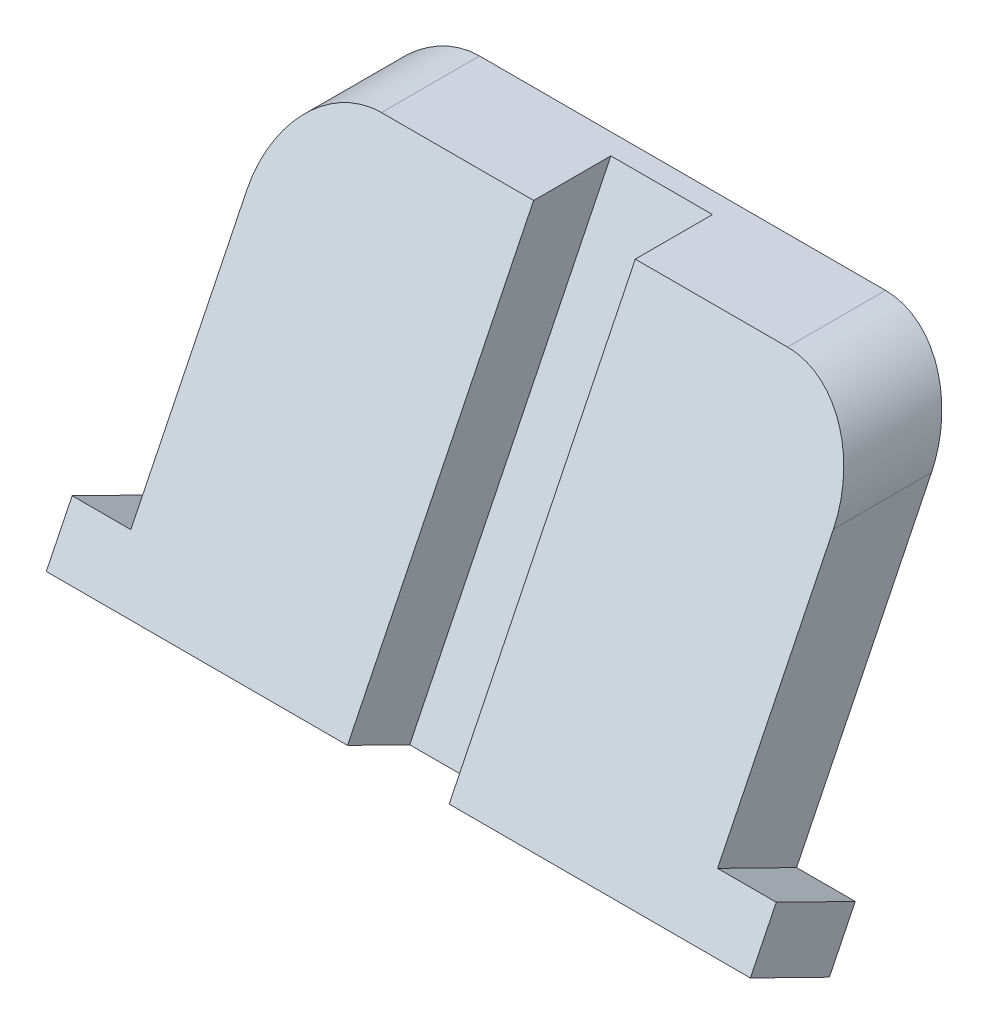
ISO-10303-21;
HEADER;
FILE_DESCRIPTION(('STEP AP214'),'2;1');
FILE_NAME('part.step','',(''),(''),'','','');
FILE_SCHEMA(('AUTOMOTIVE_DESIGN { 1 0 10303 214 1 1 1 1 }'));
ENDSEC;
DATA;
#1=APPLICATION_CONTEXT('core data for automotive mechanical design processes');
#2=APPLICATION_PROTOCOL_DEFINITION('international standard','automotive_design',2000,#1);
#3=PRODUCT_CONTEXT('',#1,'mechanical');
#4=PRODUCT('Part','Part','',(#3));
#5=PRODUCT_RELATED_PRODUCT_CATEGORY('part','',(#4));
#6=PRODUCT_DEFINITION_FORMATION('','',#4);
#7=PRODUCT_DEFINITION_CONTEXT('part definition',#1,'design');
#8=PRODUCT_DEFINITION('design','',#6,#7);
#9=PRODUCT_DEFINITION_SHAPE('','',#8);
#10=(LENGTH_UNIT() NAMED_UNIT(*) SI_UNIT(.MILLI.,.METRE.));
#11=(NAMED_UNIT(*) PLANE_ANGLE_UNIT() SI_UNIT($,.RADIAN.));
#12=(NAMED_UNIT(*) SI_UNIT($,.STERADIAN.) SOLID_ANGLE_UNIT());
#13=UNCERTAINTY_MEASURE_WITH_UNIT(LENGTH_MEASURE(1.E-05),#10,'distance_accuracy_value','');
#14=(GEOMETRIC_REPRESENTATION_CONTEXT(3) GLOBAL_UNCERTAINTY_ASSIGNED_CONTEXT((#13)) GLOBAL_UNIT_ASSIGNED_CONTEXT((#10,
#11,#12)) REPRESENTATION_CONTEXT('',''));
#15=CARTESIAN_POINT('',(0.,0.,0.));
#16=DIRECTION('',(0.,0.,1.));
#17=DIRECTION('',(1.,0.,0.));
#18=AXIS2_PLACEMENT_3D('',#15,#16,#17);
#19=CARTESIAN_POINT('',(-127.,0.,0.));
#20=DIRECTION('',(1.,0.,0.));
#21=DIRECTION('',(0.,0.,-1.));
#22=AXIS2_PLACEMENT_3D('',#19,#20,#21);
#23=PLANE('',#22);
#24=DIRECTION('',(0.,-0.440928700990651,-0.897542133073817));
#25=VECTOR('',#24,1.);
#26=CARTESIAN_POINT('',(-127.,311.889909229583,66.9616760532339));
#27=LINE('',#26,#25);
#28=CARTESIAN_POINT('',(-127.,328.689292737327,101.158031323346));
#29=VERTEX_POINT('',#28);
#30=CARTESIAN_POINT('',(-127.,311.889909229583,66.9616760532339));
#31=VERTEX_POINT('',#30);
#32=EDGE_CURVE('E56',#29,#31,#27,.T.);
#33=ORIENTED_EDGE('',*,*,#32,.F.);
#34=DIRECTION('',(0.,-0.897542133073816,0.440928700990653));
#35=VECTOR('',#34,1.);
#36=CARTESIAN_POINT('',(-127.,342.9,94.1768451900222));
#37=LINE('',#36,#35);
#38=CARTESIAN_POINT('',(-127.,430.784,51.0027405659269));
#39=VERTEX_POINT('',#38);
#40=EDGE_CURVE('E237',#39,#29,#37,.T.);
#41=ORIENTED_EDGE('',*,*,#40,.F.);
#42=DIRECTION('',(0.,0.,1.));
#43=VECTOR('',#42,1.);
#44=CARTESIAN_POINT('',(-127.,430.784,0.));
#45=LINE('',#44,#43);
#46=CARTESIAN_POINT('',(-127.,430.784,8.55347986156453));
#47=VERTEX_POINT('',#46);
#48=EDGE_CURVE('E248',#39,#47,#45,.F.);
#49=ORIENTED_EDGE('',*,*,#48,.T.);
#50=DIRECTION('',(0.,0.897542133073816,-0.440928700990653));
#51=VECTOR('',#50,1.);
#52=CARTESIAN_POINT('',(-127.,342.9,51.7275844856598));
#53=LINE('',#52,#51);
#54=EDGE_CURVE('E235',#31,#47,#53,.T.);
#55=ORIENTED_EDGE('',*,*,#54,.F.);
#56=EDGE_LOOP('',(#33,#41,#49,#55));
#57=FACE_BOUND('',#56,.T.);
#58=ADVANCED_FACE('F41',(#57),#23,.F.);
#59=CARTESIAN_POINT('',(127.,342.9,94.1768451900222));
#60=DIRECTION('',(0.,-0.440928700990653,-0.897542133073816));
#61=DIRECTION('',(0.,0.897542133073816,-0.440928700990653));
#62=AXIS2_PLACEMENT_3D('',#59,#60,#61);
#63=PLANE('',#62);
#64=ORIENTED_EDGE('',*,*,#40,.T.);
#65=DIRECTION('',(1.,0.,0.));
#66=VECTOR('',#65,1.);
#67=CARTESIAN_POINT('',(-152.4,328.689292737327,101.158031323346));
#68=LINE('',#67,#66);
#69=CARTESIAN_POINT('',(-152.4,328.689292737327,101.158031323346));
#70=VERTEX_POINT('',#69);
#71=EDGE_CURVE('E221',#70,#29,#68,.T.);
#72=ORIENTED_EDGE('',*,*,#71,.F.);
#73=DIRECTION('',(0.,0.897542133073818,-0.440928700990649));
#74=VECTOR('',#73,1.);
#75=CARTESIAN_POINT('',(-152.4,305.891722557252,112.357620328509));
#76=LINE('',#75,#74);
#77=CARTESIAN_POINT('',(-152.4,305.891722557252,112.357620328509));
#78=VERTEX_POINT('',#77);
#79=EDGE_CURVE('E213',#78,#70,#76,.T.);
#80=ORIENTED_EDGE('',*,*,#79,.F.);
#81=DIRECTION('',(1.,0.,0.));
#82=VECTOR('',#81,1.);
#83=CARTESIAN_POINT('',(-196.85,305.891722557252,112.357620328509));
#84=LINE('',#83,#82);
#85=CARTESIAN_POINT('',(-22.,305.891722557252,112.357620328509));
#86=VERTEX_POINT('',#85);
#87=EDGE_CURVE('E153',#78,#86,#84,.T.);
#88=ORIENTED_EDGE('',*,*,#87,.T.);
#89=DIRECTION('',(0.,-0.897542133073816,0.440928700990653));
#90=VECTOR('',#89,1.);
#91=CARTESIAN_POINT('',(-22.,486.699383507744,23.5336151544784));
#92=LINE('',#91,#90);
#93=CARTESIAN_POINT('',(-22.,469.9,31.7865205887285));
#94=VERTEX_POINT('',#93);
#95=EDGE_CURVE('E226',#94,#86,#92,.T.);
#96=ORIENTED_EDGE('',*,*,#95,.F.);
#97=DIRECTION('',(-1.,0.,0.));
#98=VECTOR('',#97,1.);
#99=CARTESIAN_POINT('',(127.,469.9,31.7865205887284));
#100=LINE('',#99,#98);
#101=CARTESIAN_POINT('',(-87.884,469.9,31.7865205887284));
#102=VERTEX_POINT('',#101);
#103=EDGE_CURVE('E239',#94,#102,#100,.T.);
#104=ORIENTED_EDGE('',*,*,#103,.T.);
#105=CARTESIAN_POINT('',(-87.884,430.784,51.0027405659269));
#106=DIRECTION('',(0.,-0.440928700990653,-0.897542133073816));
#107=DIRECTION('',(0.,-0.897542133073816,0.440928700990653));
#108=AXIS2_PLACEMENT_3D('',#105,#106,#107);
#109=ELLIPSE('',#108,43.5812409898121,39.116);
#110=EDGE_CURVE('E246',#102,#39,#109,.F.);
#111=ORIENTED_EDGE('',*,*,#110,.T.);
#112=EDGE_LOOP('',(#64,#72,#80,#88,#96,#104,#111));
#113=FACE_BOUND('',#112,.T.);
#114=ADVANCED_FACE('F272',(#113),#63,.F.);
#115=CARTESIAN_POINT('',(127.,342.9,51.7275844856598));
#116=DIRECTION('',(0.,0.440928700990653,0.897542133073816));
#117=DIRECTION('',(0.,-0.897542133073816,0.440928700990653));
#118=AXIS2_PLACEMENT_3D('',#115,#116,#117);
#119=PLANE('',#118);
#120=DIRECTION('',(1.,0.,0.));
#121=VECTOR('',#120,1.);
#122=CARTESIAN_POINT('',(-196.85,289.092339049508,78.1612650583964));
#123=LINE('',#122,#121);
#124=CARTESIAN_POINT('',(-152.4,289.092339049508,78.1612650583964));
#125=VERTEX_POINT('',#124);
#126=CARTESIAN_POINT('',(152.4,289.092339049508,78.1612650583964));
#127=VERTEX_POINT('',#126);
#128=EDGE_CURVE('E141',#125,#127,#123,.T.);
#129=ORIENTED_EDGE('',*,*,#128,.F.);
#130=DIRECTION('',(0.,-0.897542133073818,0.440928700990649));
#131=VECTOR('',#130,1.);
#132=CARTESIAN_POINT('',(-152.4,289.092339049508,78.1612650583964));
#133=LINE('',#132,#131);
#134=CARTESIAN_POINT('',(-152.4,311.889909229583,66.9616760532339));
#135=VERTEX_POINT('',#134);
#136=EDGE_CURVE('E210',#135,#125,#133,.T.);
#137=ORIENTED_EDGE('',*,*,#136,.F.);
#138=DIRECTION('',(1.,0.,0.));
#139=VECTOR('',#138,1.);
#140=CARTESIAN_POINT('',(-152.4,311.889909229583,66.9616760532339));
#141=LINE('',#140,#139);
#142=EDGE_CURVE('E217',#135,#31,#141,.T.);
#143=ORIENTED_EDGE('',*,*,#142,.T.);
#144=ORIENTED_EDGE('',*,*,#54,.T.);
#145=CARTESIAN_POINT('',(-87.884,430.784,8.55347986156452));
#146=DIRECTION('',(0.,0.440928700990653,0.897542133073816));
#147=DIRECTION('',(0.,-0.897542133073816,0.440928700990653));
#148=AXIS2_PLACEMENT_3D('',#145,#146,#147);
#149=ELLIPSE('',#148,43.5812409898121,39.116);
#150=CARTESIAN_POINT('',(-87.884,469.9,-10.6627401156339));
#151=VERTEX_POINT('',#150);
#152=EDGE_CURVE('E251',#47,#151,#149,.F.);
#153=ORIENTED_EDGE('',*,*,#152,.T.);
#154=DIRECTION('',(-1.,0.,0.));
#155=VECTOR('',#154,1.);
#156=CARTESIAN_POINT('',(127.,469.9,-10.6627401156339));
#157=LINE('',#156,#155);
#158=CARTESIAN_POINT('',(87.884,469.9,-10.6627401156339));
#159=VERTEX_POINT('',#158);
#160=EDGE_CURVE('E241',#159,#151,#157,.T.);
#161=ORIENTED_EDGE('',*,*,#160,.F.);
#162=CARTESIAN_POINT('',(87.884,430.784,8.55347986156452));
#163=DIRECTION('',(0.,-0.440928700990653,-0.897542133073816));
#164=DIRECTION('',(0.,-0.897542133073816,0.440928700990653));
#165=AXIS2_PLACEMENT_3D('',#162,#163,#164);
#166=ELLIPSE('',#165,43.5812409898121,39.116);
#167=CARTESIAN_POINT('',(127.,430.784,8.55347986156453));
#168=VERTEX_POINT('',#167);
#169=EDGE_CURVE('E205',#168,#159,#166,.F.);
#170=ORIENTED_EDGE('',*,*,#169,.F.);
#171=DIRECTION('',(0.,0.897542133073816,-0.440928700990653));
#172=VECTOR('',#171,1.);
#173=CARTESIAN_POINT('',(127.,342.9,51.7275844856598));
#174=LINE('',#173,#172);
#175=CARTESIAN_POINT('',(127.,311.889909229583,66.9616760532339));
#176=VERTEX_POINT('',#175);
#177=EDGE_CURVE('E189',#176,#168,#174,.T.);
#178=ORIENTED_EDGE('',*,*,#177,.F.);
#179=DIRECTION('',(-1.,0.,0.));
#180=VECTOR('',#179,1.);
#181=CARTESIAN_POINT('',(152.4,311.889909229583,66.9616760532339));
#182=LINE('',#181,#180);
#183=CARTESIAN_POINT('',(152.4,311.889909229583,66.9616760532339));
#184=VERTEX_POINT('',#183);
#185=EDGE_CURVE('E166',#184,#176,#182,.T.);
#186=ORIENTED_EDGE('',*,*,#185,.F.);
#187=DIRECTION('',(0.,-0.897542133073818,0.440928700990649));
#188=VECTOR('',#187,1.);
#189=CARTESIAN_POINT('',(152.4,289.092339049508,78.1612650583964));
#190=LINE('',#189,#188);
#191=EDGE_CURVE('E158',#184,#127,#190,.T.);
#192=ORIENTED_EDGE('',*,*,#191,.T.);
#193=EDGE_LOOP('',(#129,#137,#143,#144,#153,#161,#170,#178,#186,#192));
#194=FACE_BOUND('',#193,.T.);
#195=ADVANCED_FACE('F164',(#194),#119,.F.);
#196=CARTESIAN_POINT('',(-196.85,292.663861527532,85.4313563362943));
#197=DIRECTION('',(0.,-0.897542133073818,0.440928700990649));
#198=DIRECTION('',(0.,-0.440928700990649,-0.897542133073818));
#199=AXIS2_PLACEMENT_3D('',#196,#197,#198);
#200=PLANE('',#199);
#201=ORIENTED_EDGE('',*,*,#87,.F.);
#202=DIRECTION('',(0.,0.440928700990649,0.897542133073818));
#203=VECTOR('',#202,1.);
#204=CARTESIAN_POINT('',(-152.4,289.092339049508,78.1612650583964));
#205=LINE('',#204,#203);
#206=EDGE_CURVE('E148',#125,#78,#205,.T.);
#207=ORIENTED_EDGE('',*,*,#206,.F.);
#208=ORIENTED_EDGE('',*,*,#128,.T.);
#209=DIRECTION('',(0.,0.440928700990649,0.897542133073818));
#210=VECTOR('',#209,1.);
#211=CARTESIAN_POINT('',(152.4,289.092339049508,78.1612650583964));
#212=LINE('',#211,#210);
#213=CARTESIAN_POINT('',(152.4,305.891722557252,112.357620328509));
#214=VERTEX_POINT('',#213);
#215=EDGE_CURVE('E145',#127,#214,#212,.T.);
#216=ORIENTED_EDGE('',*,*,#215,.T.);
#217=DIRECTION('',(-1.,0.,0.));
#218=VECTOR('',#217,1.);
#219=CARTESIAN_POINT('',(196.85,305.891722557252,112.357620328509));
#220=LINE('',#219,#218);
#221=CARTESIAN_POINT('',(22.,305.891722557252,112.357620328509));
#222=VERTEX_POINT('',#221);
#223=EDGE_CURVE('E178',#214,#222,#220,.T.);
#224=ORIENTED_EDGE('',*,*,#223,.T.);
#225=DIRECTION('',(0.,0.440928700990649,0.897542133073818));
#226=VECTOR('',#225,1.);
#227=CARTESIAN_POINT('',(22.,292.663861527532,85.4313563362935));
#228=LINE('',#227,#226);
#229=CARTESIAN_POINT('',(22.,292.663861527532,85.4313563362943));
#230=VERTEX_POINT('',#229);
#231=EDGE_CURVE('E208',#230,#222,#228,.T.);
#232=ORIENTED_EDGE('',*,*,#231,.F.);
#233=DIRECTION('',(-1.,0.,0.));
#234=VECTOR('',#233,1.);
#235=CARTESIAN_POINT('',(0.,292.663861527532,85.4313563362944));
#236=LINE('',#235,#234);
#237=CARTESIAN_POINT('',(-22.,292.663861527532,85.4313563362943));
#238=VERTEX_POINT('',#237);
#239=EDGE_CURVE('E63',#230,#238,#236,.T.);
#240=ORIENTED_EDGE('',*,*,#239,.T.);
#241=DIRECTION('',(0.,0.440928700990649,0.897542133073818));
#242=VECTOR('',#241,1.);
#243=CARTESIAN_POINT('',(-22.,292.663861527532,85.4313563362935));
#244=LINE('',#243,#242);
#245=EDGE_CURVE('E12',#238,#86,#244,.T.);
#246=ORIENTED_EDGE('',*,*,#245,.T.);
#247=EDGE_LOOP('',(#201,#207,#208,#216,#224,#232,#240,#246));
#248=FACE_BOUND('',#247,.T.);
#249=ADVANCED_FACE('F143',(#248),#200,.T.);
#250=CARTESIAN_POINT('',(0.,90.7087951120338,184.644286639749));
#251=DIRECTION('',(0.,-0.440928700990653,-0.897542133073816));
#252=DIRECTION('',(0.,0.897542133073816,-0.440928700990653));
#253=AXIS2_PLACEMENT_3D('',#250,#251,#252);
#254=PLANE('',#253);
#255=ORIENTED_EDGE('',*,*,#239,.F.);
#256=DIRECTION('',(0.,-0.897542133073816,0.440928700990653));
#257=VECTOR('',#256,1.);
#258=CARTESIAN_POINT('',(22.,473.471522478024,-3.39264883773606));
#259=LINE('',#258,#257);
#260=CARTESIAN_POINT('',(22.,469.9,-1.63809413911589));
#261=VERTEX_POINT('',#260);
#262=EDGE_CURVE('E181',#261,#230,#259,.T.);
#263=ORIENTED_EDGE('',*,*,#262,.F.);
#264=DIRECTION('',(1.,0.,0.));
#265=VECTOR('',#264,1.);
#266=CARTESIAN_POINT('',(127.,469.9,-1.63809413911582));
#267=LINE('',#266,#265);
#268=CARTESIAN_POINT('',(-22.,469.9,-1.63809413911589));
#269=VERTEX_POINT('',#268);
#270=EDGE_CURVE('E49',#269,#261,#267,.T.);
#271=ORIENTED_EDGE('',*,*,#270,.F.);
#272=DIRECTION('',(0.,-0.897542133073816,0.440928700990653));
#273=VECTOR('',#272,1.);
#274=CARTESIAN_POINT('',(-22.,473.471522478024,-3.39264883773606));
#275=LINE('',#274,#273);
#276=EDGE_CURVE('E227',#269,#238,#275,.T.);
#277=ORIENTED_EDGE('',*,*,#276,.T.);
#278=EDGE_LOOP('',(#255,#263,#271,#277));
#279=FACE_BOUND('',#278,.T.);
#280=ADVANCED_FACE('F263',(#279),#254,.F.);
#281=CARTESIAN_POINT('',(-22.,473.471522478024,-3.39264883773606));
#282=DIRECTION('',(-1.,0.,0.));
#283=DIRECTION('',(0.,-1.,0.));
#284=AXIS2_PLACEMENT_3D('',#281,#282,#283);
#285=PLANE('',#284);
#286=ORIENTED_EDGE('',*,*,#245,.F.);
#287=ORIENTED_EDGE('',*,*,#276,.F.);
#288=DIRECTION('',(0.,0.,-1.));
#289=VECTOR('',#288,1.);
#290=CARTESIAN_POINT('',(-22.,469.9,31.7865205887285));
#291=LINE('',#290,#289);
#292=EDGE_CURVE('E230',#94,#269,#291,.T.);
#293=ORIENTED_EDGE('',*,*,#292,.F.);
#294=ORIENTED_EDGE('',*,*,#95,.T.);
#295=EDGE_LOOP('',(#286,#287,#293,#294));
#296=FACE_BOUND('',#295,.T.);
#297=ADVANCED_FACE('F265',(#296),#285,.F.);
#298=CARTESIAN_POINT('',(127.,469.9,31.7865205887284));
#299=DIRECTION('',(0.,-1.,0.));
#300=DIRECTION('',(0.,0.,-1.));
#301=AXIS2_PLACEMENT_3D('',#298,#299,#300);
#302=PLANE('',#301);
#303=ORIENTED_EDGE('',*,*,#103,.F.);
#304=ORIENTED_EDGE('',*,*,#292,.T.);
#305=ORIENTED_EDGE('',*,*,#270,.T.);
#306=DIRECTION('',(0.,0.,-1.));
#307=VECTOR('',#306,1.);
#308=CARTESIAN_POINT('',(22.,469.9,31.7865205887285));
#309=LINE('',#308,#307);
#310=CARTESIAN_POINT('',(22.,469.9,31.7865205887285));
#311=VERTEX_POINT('',#310);
#312=EDGE_CURVE('E184',#311,#261,#309,.T.);
#313=ORIENTED_EDGE('',*,*,#312,.F.);
#314=DIRECTION('',(1.,0.,0.));
#315=VECTOR('',#314,1.);
#316=CARTESIAN_POINT('',(-127.,469.9,31.7865205887284));
#317=LINE('',#316,#315);
#318=CARTESIAN_POINT('',(87.884,469.9,31.7865205887284));
#319=VERTEX_POINT('',#318);
#320=EDGE_CURVE('E195',#311,#319,#317,.T.);
#321=ORIENTED_EDGE('',*,*,#320,.T.);
#322=DIRECTION('',(0.,0.,1.));
#323=VECTOR('',#322,1.);
#324=CARTESIAN_POINT('',(87.884,469.9,31.7865205887284));
#325=LINE('',#324,#323);
#326=EDGE_CURVE('E198',#159,#319,#325,.T.);
#327=ORIENTED_EDGE('',*,*,#326,.F.);
#328=ORIENTED_EDGE('',*,*,#160,.T.);
#329=DIRECTION('',(0.,0.,1.));
#330=VECTOR('',#329,1.);
#331=CARTESIAN_POINT('',(-87.884,469.9,31.7865205887284));
#332=LINE('',#331,#330);
#333=EDGE_CURVE('E243',#151,#102,#332,.T.);
#334=ORIENTED_EDGE('',*,*,#333,.T.);
#335=EDGE_LOOP('',(#303,#304,#305,#313,#321,#327,#328,#334));
#336=FACE_BOUND('',#335,.T.);
#337=ADVANCED_FACE('F255',(#336),#302,.F.);
#338=CARTESIAN_POINT('',(-87.884,430.784,31.7865205887284));
#339=DIRECTION('',(0.,0.,1.));
#340=DIRECTION('',(1.,0.,0.));
#341=AXIS2_PLACEMENT_3D('',#338,#339,#340);
#342=CYLINDRICAL_SURFACE('',#341,39.116);
#343=ORIENTED_EDGE('',*,*,#152,.F.);
#344=ORIENTED_EDGE('',*,*,#48,.F.);
#345=ORIENTED_EDGE('',*,*,#110,.F.);
#346=ORIENTED_EDGE('',*,*,#333,.F.);
#347=EDGE_LOOP('',(#343,#344,#345,#346));
#348=FACE_BOUND('',#347,.T.);
#349=ADVANCED_FACE('F43',(#348),#342,.T.);
#350=CARTESIAN_POINT('',(-152.4,311.889909229583,66.9616760532339));
#351=DIRECTION('',(0.,-0.897542133073817,0.440928700990651));
#352=DIRECTION('',(0.,-0.440928700990651,-0.897542133073817));
#353=AXIS2_PLACEMENT_3D('',#350,#351,#352);
#354=PLANE('',#353);
#355=ORIENTED_EDGE('',*,*,#32,.T.);
#356=ORIENTED_EDGE('',*,*,#142,.F.);
#357=DIRECTION('',(0.,-0.440928700990651,-0.897542133073817));
#358=VECTOR('',#357,1.);
#359=CARTESIAN_POINT('',(-152.4,311.889909229583,66.9616760532339));
#360=LINE('',#359,#358);
#361=EDGE_CURVE('E215',#70,#135,#360,.T.);
#362=ORIENTED_EDGE('',*,*,#361,.F.);
#363=ORIENTED_EDGE('',*,*,#71,.T.);
#364=EDGE_LOOP('',(#355,#356,#362,#363));
#365=FACE_BOUND('',#364,.T.);
#366=ADVANCED_FACE('F276',(#365),#354,.F.);
#367=CARTESIAN_POINT('',(-152.4,0.,0.));
#368=DIRECTION('',(1.,0.,0.));
#369=DIRECTION('',(0.,0.,-1.));
#370=AXIS2_PLACEMENT_3D('',#367,#368,#369);
#371=PLANE('',#370);
#372=ORIENTED_EDGE('',*,*,#136,.T.);
#373=ORIENTED_EDGE('',*,*,#206,.T.);
#374=ORIENTED_EDGE('',*,*,#79,.T.);
#375=ORIENTED_EDGE('',*,*,#361,.T.);
#376=EDGE_LOOP('',(#372,#373,#374,#375));
#377=FACE_BOUND('',#376,.T.);
#378=ADVANCED_FACE('F270',(#377),#371,.F.);
#379=CARTESIAN_POINT('',(127.,0.,0.));
#380=DIRECTION('',(-1.,0.,0.));
#381=DIRECTION('',(0.,0.,-1.));
#382=AXIS2_PLACEMENT_3D('',#379,#380,#381);
#383=PLANE('',#382);
#384=DIRECTION('',(0.,-0.440928700990651,-0.897542133073817));
#385=VECTOR('',#384,1.);
#386=CARTESIAN_POINT('',(127.,311.889909229583,66.9616760532339));
#387=LINE('',#386,#385);
#388=CARTESIAN_POINT('',(127.,328.689292737327,101.158031323346));
#389=VERTEX_POINT('',#388);
#390=EDGE_CURVE('E167',#389,#176,#387,.T.);
#391=ORIENTED_EDGE('',*,*,#390,.T.);
#392=ORIENTED_EDGE('',*,*,#177,.T.);
#393=DIRECTION('',(0.,0.,1.));
#394=VECTOR('',#393,1.);
#395=CARTESIAN_POINT('',(127.,430.784,0.));
#396=LINE('',#395,#394);
#397=CARTESIAN_POINT('',(127.,430.784,51.0027405659269));
#398=VERTEX_POINT('',#397);
#399=EDGE_CURVE('E202',#398,#168,#396,.F.);
#400=ORIENTED_EDGE('',*,*,#399,.F.);
#401=DIRECTION('',(0.,-0.897542133073816,0.440928700990653));
#402=VECTOR('',#401,1.);
#403=CARTESIAN_POINT('',(127.,342.9,94.1768451900222));
#404=LINE('',#403,#402);
#405=EDGE_CURVE('E192',#398,#389,#404,.T.);
#406=ORIENTED_EDGE('',*,*,#405,.T.);
#407=EDGE_LOOP('',(#391,#392,#400,#406));
#408=FACE_BOUND('',#407,.T.);
#409=ADVANCED_FACE('F289',(#408),#383,.F.);
#410=CARTESIAN_POINT('',(-127.,342.9,94.1768451900222));
#411=DIRECTION('',(0.,-0.440928700990653,-0.897542133073816));
#412=DIRECTION('',(0.,0.897542133073816,-0.440928700990653));
#413=AXIS2_PLACEMENT_3D('',#410,#411,#412);
#414=PLANE('',#413);
#415=ORIENTED_EDGE('',*,*,#405,.F.);
#416=CARTESIAN_POINT('',(87.884,430.784,51.0027405659269));
#417=DIRECTION('',(0.,0.440928700990653,0.897542133073816));
#418=DIRECTION('',(0.,-0.897542133073816,0.440928700990653));
#419=AXIS2_PLACEMENT_3D('',#416,#417,#418);
#420=ELLIPSE('',#419,43.5812409898121,39.116);
#421=EDGE_CURVE('E200',#319,#398,#420,.F.);
#422=ORIENTED_EDGE('',*,*,#421,.F.);
#423=ORIENTED_EDGE('',*,*,#320,.F.);
#424=DIRECTION('',(0.,-0.897542133073816,0.440928700990653));
#425=VECTOR('',#424,1.);
#426=CARTESIAN_POINT('',(22.,486.699383507744,23.5336151544784));
#427=LINE('',#426,#425);
#428=EDGE_CURVE('E180',#311,#222,#427,.T.);
#429=ORIENTED_EDGE('',*,*,#428,.T.);
#430=ORIENTED_EDGE('',*,*,#223,.F.);
#431=DIRECTION('',(0.,0.897542133073818,-0.440928700990649));
#432=VECTOR('',#431,1.);
#433=CARTESIAN_POINT('',(152.4,305.891722557252,112.357620328509));
#434=LINE('',#433,#432);
#435=CARTESIAN_POINT('',(152.4,328.689292737327,101.158031323346));
#436=VERTEX_POINT('',#435);
#437=EDGE_CURVE('E161',#214,#436,#434,.T.);
#438=ORIENTED_EDGE('',*,*,#437,.T.);
#439=DIRECTION('',(-1.,0.,0.));
#440=VECTOR('',#439,1.);
#441=CARTESIAN_POINT('',(152.4,328.689292737327,101.158031323346));
#442=LINE('',#441,#440);
#443=EDGE_CURVE('E176',#436,#389,#442,.T.);
#444=ORIENTED_EDGE('',*,*,#443,.T.);
#445=EDGE_LOOP('',(#415,#422,#423,#429,#430,#438,#444));
#446=FACE_BOUND('',#445,.T.);
#447=ADVANCED_FACE('F295',(#446),#414,.F.);
#448=CARTESIAN_POINT('',(22.,473.471522478024,-3.39264883773606));
#449=DIRECTION('',(1.,0.,0.));
#450=DIRECTION('',(0.,-1.,0.));
#451=AXIS2_PLACEMENT_3D('',#448,#449,#450);
#452=PLANE('',#451);
#453=ORIENTED_EDGE('',*,*,#231,.T.);
#454=ORIENTED_EDGE('',*,*,#428,.F.);
#455=ORIENTED_EDGE('',*,*,#312,.T.);
#456=ORIENTED_EDGE('',*,*,#262,.T.);
#457=EDGE_LOOP('',(#453,#454,#455,#456));
#458=FACE_BOUND('',#457,.T.);
#459=ADVANCED_FACE('F261',(#458),#452,.F.);
#460=CARTESIAN_POINT('',(87.884,430.784,31.7865205887284));
#461=DIRECTION('',(0.,0.,1.));
#462=DIRECTION('',(-1.,0.,0.));
#463=AXIS2_PLACEMENT_3D('',#460,#461,#462);
#464=CYLINDRICAL_SURFACE('',#463,39.116);
#465=ORIENTED_EDGE('',*,*,#169,.T.);
#466=ORIENTED_EDGE('',*,*,#326,.T.);
#467=ORIENTED_EDGE('',*,*,#421,.T.);
#468=ORIENTED_EDGE('',*,*,#399,.T.);
#469=EDGE_LOOP('',(#465,#466,#467,#468));
#470=FACE_BOUND('',#469,.T.);
#471=ADVANCED_FACE('F285',(#470),#464,.T.);
#472=CARTESIAN_POINT('',(152.4,311.889909229583,66.9616760532339));
#473=DIRECTION('',(0.,-0.897542133073817,0.440928700990651));
#474=DIRECTION('',(0.,-0.440928700990651,-0.897542133073817));
#475=AXIS2_PLACEMENT_3D('',#472,#473,#474);
#476=PLANE('',#475);
#477=ORIENTED_EDGE('',*,*,#390,.F.);
#478=ORIENTED_EDGE('',*,*,#443,.F.);
#479=DIRECTION('',(0.,-0.440928700990651,-0.897542133073817));
#480=VECTOR('',#479,1.);
#481=CARTESIAN_POINT('',(152.4,311.889909229583,66.9616760532339));
#482=LINE('',#481,#480);
#483=EDGE_CURVE('E173',#436,#184,#482,.T.);
#484=ORIENTED_EDGE('',*,*,#483,.T.);
#485=ORIENTED_EDGE('',*,*,#185,.T.);
#486=EDGE_LOOP('',(#477,#478,#484,#485));
#487=FACE_BOUND('',#486,.T.);
#488=ADVANCED_FACE('F293',(#487),#476,.F.);
#489=CARTESIAN_POINT('',(152.4,0.,0.));
#490=DIRECTION('',(-1.,0.,0.));
#491=DIRECTION('',(0.,0.,-1.));
#492=AXIS2_PLACEMENT_3D('',#489,#490,#491);
#493=PLANE('',#492);
#494=ORIENTED_EDGE('',*,*,#191,.F.);
#495=ORIENTED_EDGE('',*,*,#483,.F.);
#496=ORIENTED_EDGE('',*,*,#437,.F.);
#497=ORIENTED_EDGE('',*,*,#215,.F.);
#498=EDGE_LOOP('',(#494,#495,#496,#497));
#499=FACE_BOUND('',#498,.T.);
#500=ADVANCED_FACE('F157',(#499),#493,.F.);
#501=CLOSED_SHELL('',(#58,#114,#195,#249,#280,#297,#337,#349,#366,#378,#409,#447,#459,#471,#488,#500));
#502=MANIFOLD_SOLID_BREP('B2',#501);
#503=ADVANCED_BREP_SHAPE_REPRESENTATION('',(#18,#502),#14);
#504=SHAPE_DEFINITION_REPRESENTATION(#9,#503);
ENDSEC;
END-ISO-10303-21;
